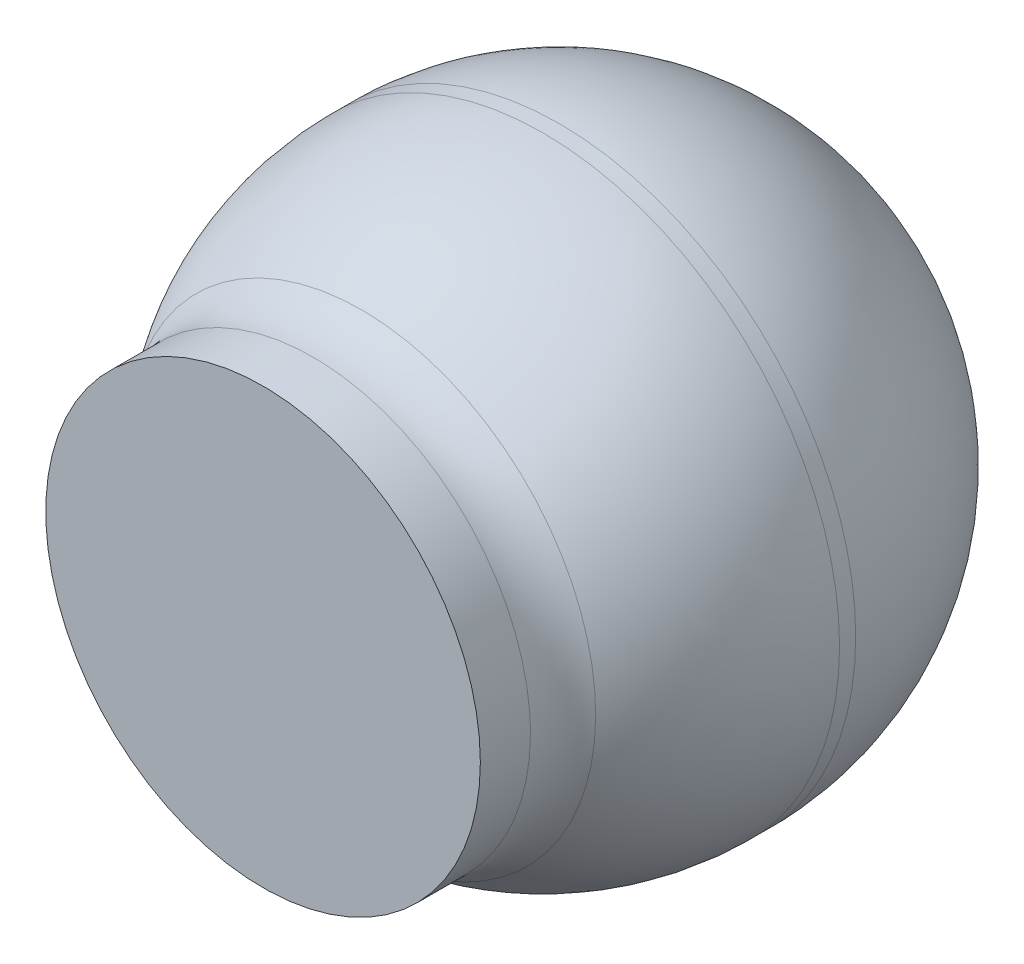
ISO-10303-21;
HEADER;
FILE_DESCRIPTION(('STEP AP214'),'2;1');
FILE_NAME('part.step','',(''),(''),'','','');
FILE_SCHEMA(('AUTOMOTIVE_DESIGN { 1 0 10303 214 1 1 1 1 }'));
ENDSEC;
DATA;
#1=APPLICATION_CONTEXT('core data for automotive mechanical design processes');
#2=APPLICATION_PROTOCOL_DEFINITION('international standard','automotive_design',2000,#1);
#3=PRODUCT_CONTEXT('',#1,'mechanical');
#4=PRODUCT('Part','Part','',(#3));
#5=PRODUCT_RELATED_PRODUCT_CATEGORY('part','',(#4));
#6=PRODUCT_DEFINITION_FORMATION('','',#4);
#7=PRODUCT_DEFINITION_CONTEXT('part definition',#1,'design');
#8=PRODUCT_DEFINITION('design','',#6,#7);
#9=PRODUCT_DEFINITION_SHAPE('','',#8);
#10=(LENGTH_UNIT() NAMED_UNIT(*) SI_UNIT(.MILLI.,.METRE.));
#11=(NAMED_UNIT(*) PLANE_ANGLE_UNIT() SI_UNIT($,.RADIAN.));
#12=(NAMED_UNIT(*) SI_UNIT($,.STERADIAN.) SOLID_ANGLE_UNIT());
#13=UNCERTAINTY_MEASURE_WITH_UNIT(LENGTH_MEASURE(1.E-05),#10,'distance_accuracy_value','');
#14=(GEOMETRIC_REPRESENTATION_CONTEXT(3) GLOBAL_UNCERTAINTY_ASSIGNED_CONTEXT((#13)) GLOBAL_UNIT_ASSIGNED_CONTEXT((#10,
#11,#12)) REPRESENTATION_CONTEXT('',''));
#15=CARTESIAN_POINT('',(0.,0.,0.));
#16=DIRECTION('',(0.,0.,1.));
#17=DIRECTION('',(1.,0.,0.));
#18=AXIS2_PLACEMENT_3D('',#15,#16,#17);
#19=CARTESIAN_POINT('',(1.977080077732,-0.241349291452,10.006534503384));
#20=DIRECTION('',(0.,0.,-1.));
#21=DIRECTION('',(-1.,0.,0.));
#22=AXIS2_PLACEMENT_3D('',#19,#20,#21);
#23=PLANE('',#22);
#24=CARTESIAN_POINT('',(1.977080077732,-0.241349291452,10.006534503384));
#25=DIRECTION('',(0.,0.,1.));
#26=DIRECTION('',(1.,0.,0.));
#27=AXIS2_PLACEMENT_3D('',#24,#25,#26);
#28=CIRCLE('',#27,0.275);
#29=CARTESIAN_POINT('',(2.252080077732,-0.241349291452,10.006534503384));
#30=VERTEX_POINT('',#29);
#31=EDGE_CURVE('E20',#30,#30,#28,.F.);
#32=ORIENTED_EDGE('',*,*,#31,.F.);
#33=EDGE_LOOP('',(#32));
#34=FACE_BOUND('',#33,.T.);
#35=ADVANCED_FACE('F17',(#34),#23,.F.);
#36=CARTESIAN_POINT('',(1.977080077732,-0.241349291452,9.906534503384));
#37=DIRECTION('',(0.,0.,1.));
#38=DIRECTION('',(1.,0.,0.));
#39=AXIS2_PLACEMENT_3D('',#36,#37,#38);
#40=CYLINDRICAL_SURFACE('',#39,0.275);
#41=CARTESIAN_POINT('',(1.977080077732,-0.241349291452,9.943180457728));
#42=DIRECTION('',(0.,0.,-1.));
#43=DIRECTION('',(0.996700902337582,0.0811622527992461,0.));
#44=AXIS2_PLACEMENT_3D('',#41,#42,#43);
#45=CIRCLE('',#44,0.275);
#46=CARTESIAN_POINT('',(2.25117282587484,-0.219029671932207,9.943180457728));
#47=VERTEX_POINT('',#46);
#48=EDGE_CURVE('E65',#47,#47,#45,.F.);
#49=ORIENTED_EDGE('',*,*,#48,.T.);
#50=EDGE_LOOP('',(#49));
#51=FACE_BOUND('',#50,.T.);
#52=ORIENTED_EDGE('',*,*,#31,.T.);
#53=EDGE_LOOP('',(#52));
#54=FACE_BOUND('',#53,.T.);
#55=ADVANCED_FACE('F62',(#51,#54),#40,.T.);
#56=CARTESIAN_POINT('',(1.977080077732,-0.241349291452,9.943180457728));
#57=DIRECTION('',(0.,0.,-1.));
#58=DIRECTION('',(0.996700902337583,0.081162252799246,0.));
#59=AXIS2_PLACEMENT_3D('',#56,#57,#58);
#60=TOROIDAL_SURFACE('',#59,0.375,0.1);
#61=ORIENTED_EDGE('',*,*,#48,.F.);
#62=EDGE_LOOP('',(#61));
#63=FACE_BOUND('',#62,.T.);
#64=CARTESIAN_POINT('',(1.977080077732,-0.241349291452,9.881744931236));
#65=DIRECTION('',(0.,0.,-1.));
#66=DIRECTION('',(-0.99670090233762,-0.0811622527987874,0.));
#67=AXIS2_PLACEMENT_3D('',#64,#65,#66);
#68=CIRCLE('',#67,0.296097046413662);
#69=CARTESIAN_POINT('',(1.681959884392,-0.265381194786,9.881744931236));
#70=VERTEX_POINT('',#69);
#71=EDGE_CURVE('E39',#70,#70,#68,.T.);
#72=ORIENTED_EDGE('',*,*,#71,.F.);
#73=EDGE_LOOP('',(#72));
#74=FACE_BOUND('',#73,.T.);
#75=ADVANCED_FACE('F57',(#63,#74),#60,.F.);
#76=CARTESIAN_POINT('',(1.603317239355,-0.271785136252,9.651976062157));
#77=CARTESIAN_POINT('',(1.603317239355,-0.271785136252,9.701461392103));
#78=CARTESIAN_POINT('',(1.611473782652,-0.271120941579,9.750947004335));
#79=CARTESIAN_POINT('',(1.627792914651,-0.269792059952,9.798626332797));
#80=CARTESIAN_POINT('',(1.651658609162,-0.267848654938,9.842699544317));
#81=CARTESIAN_POINT('',(1.681959884392,-0.265381194786,9.881744931236));
#82=(BOUNDED_CURVE() B_SPLINE_CURVE(5,(#76,#77,#78,#79,#80,#81),.UNSPECIFIED.,.F.,
.F.) B_SPLINE_CURVE_WITH_KNOTS((6,6),(0.,0.661568582165),
.UNSPECIFIED.) CURVE() GEOMETRIC_REPRESENTATION_ITEM() RATIONAL_B_SPLINE_CURVE((1.,1.,1.,1.,1.,1.)) REPRESENTATION_ITEM(''));
#83=CARTESIAN_POINT('',(1.977080077732,-0.241349291452,9.651976062157));
#84=DIRECTION('',(0.,0.,-1.));
#85=AXIS1_PLACEMENT('',#83,#84);
#86=SURFACE_OF_REVOLUTION('',#82,#85);
#87=CARTESIAN_POINT('',(1.977080077732,-0.241349291452,9.651976062157));
#88=DIRECTION('',(0.,0.,1.));
#89=DIRECTION('',(1.,0.,0.));
#90=AXIS2_PLACEMENT_3D('',#87,#88,#89);
#91=CIRCLE('',#90,0.375);
#92=CARTESIAN_POINT('',(2.352080077732,-0.241349291452,9.651976062157));
#93=VERTEX_POINT('',#92);
#94=EDGE_CURVE('E36',#93,#93,#91,.F.);
#95=ORIENTED_EDGE('',*,*,#94,.F.);
#96=EDGE_LOOP('',(#95));
#97=FACE_BOUND('',#96,.T.);
#98=ORIENTED_EDGE('',*,*,#71,.T.);
#99=EDGE_LOOP('',(#98));
#100=FACE_BOUND('',#99,.T.);
#101=ADVANCED_FACE('F53',(#97,#100),#86,.F.);
#102=CARTESIAN_POINT('',(1.977080077732,-0.241349291452,9.256534503384));
#103=DIRECTION('',(0.,0.,1.));
#104=DIRECTION('',(1.,0.,0.));
#105=AXIS2_PLACEMENT_3D('',#102,#103,#104);
#106=CYLINDRICAL_SURFACE('',#105,0.375);
#107=CARTESIAN_POINT('',(1.977080077732,-0.241349291452,9.631534503384));
#108=DIRECTION('',(0.,0.,-1.));
#109=DIRECTION('',(0.0811622527992356,-0.996700902337583,0.));
#110=AXIS2_PLACEMENT_3D('',#107,#108,#109);
#111=CIRCLE('',#110,0.375);
#112=CARTESIAN_POINT('',(2.00751592253171,-0.615112129828594,9.631534503384));
#113=VERTEX_POINT('',#112);
#114=CARTESIAN_POINT('',(1.94664423293229,0.132413546924594,9.631534503384));
#115=VERTEX_POINT('',#114);
#116=EDGE_CURVE('E11',#113,#115,#111,.T.);
#117=ORIENTED_EDGE('',*,*,#116,.F.);
#118=CARTESIAN_POINT('',(1.977080077732,-0.241349291452,9.631534503384));
#119=DIRECTION('',(0.,0.,1.));
#120=DIRECTION('',(0.0811622527992365,-0.996700902337583,0.));
#121=AXIS2_PLACEMENT_3D('',#118,#119,#120);
#122=CIRCLE('',#121,0.375);
#123=EDGE_CURVE('E25',#115,#113,#122,.F.);
#124=ORIENTED_EDGE('',*,*,#123,.F.);
#125=EDGE_LOOP('',(#117,#124));
#126=FACE_BOUND('',#125,.T.);
#127=ORIENTED_EDGE('',*,*,#94,.T.);
#128=EDGE_LOOP('',(#127));
#129=FACE_BOUND('',#128,.T.);
#130=ADVANCED_FACE('F34',(#126,#129),#106,.T.);
#131=CARTESIAN_POINT('',(1.977080077732,-0.241349291452,9.631534503384));
#132=DIRECTION('',(0.0811622527992361,-0.996700902337583,0.));
#133=DIRECTION('',(-0.996700902337583,-0.0811622527992361,0.));
#134=AXIS2_PLACEMENT_3D('',#131,#132,#133);
#135=SPHERICAL_SURFACE('',#134,0.375);
#136=ORIENTED_EDGE('',*,*,#123,.T.);
#137=ORIENTED_EDGE('',*,*,#116,.T.);
#138=EDGE_LOOP('',(#136,#137));
#139=FACE_BOUND('',#138,.T.);
#140=ADVANCED_FACE('F32',(#139),#135,.T.);
#141=CLOSED_SHELL('',(#35,#55,#75,#101,#130,#140));
#142=MANIFOLD_SOLID_BREP('B1',#141);
#143=ADVANCED_BREP_SHAPE_REPRESENTATION('',(#18,#142),#14);
#144=SHAPE_DEFINITION_REPRESENTATION(#9,#143);
ENDSEC;
END-ISO-10303-21;
